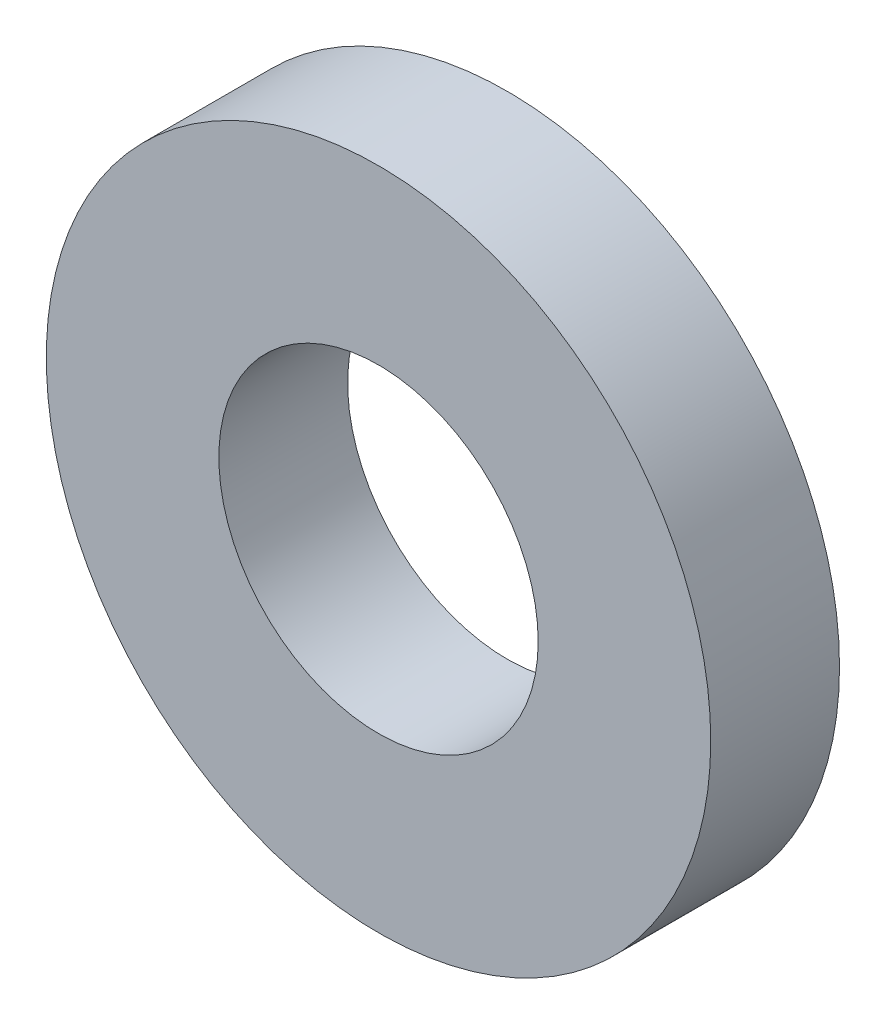
ISO-10303-21;
HEADER;
FILE_DESCRIPTION(('STEP AP214'),'2;1');
FILE_NAME('part.step','',(''),(''),'','','');
FILE_SCHEMA(('AUTOMOTIVE_DESIGN { 1 0 10303 214 1 1 1 1 }'));
ENDSEC;
DATA;
#1=APPLICATION_CONTEXT('core data for automotive mechanical design processes');
#2=APPLICATION_PROTOCOL_DEFINITION('international standard','automotive_design',2000,#1);
#3=PRODUCT_CONTEXT('',#1,'mechanical');
#4=PRODUCT('Part','Part','',(#3));
#5=PRODUCT_RELATED_PRODUCT_CATEGORY('part','',(#4));
#6=PRODUCT_DEFINITION_FORMATION('','',#4);
#7=PRODUCT_DEFINITION_CONTEXT('part definition',#1,'design');
#8=PRODUCT_DEFINITION('design','',#6,#7);
#9=PRODUCT_DEFINITION_SHAPE('','',#8);
#10=(LENGTH_UNIT() NAMED_UNIT(*) SI_UNIT(.MILLI.,.METRE.));
#11=(NAMED_UNIT(*) PLANE_ANGLE_UNIT() SI_UNIT($,.RADIAN.));
#12=(NAMED_UNIT(*) SI_UNIT($,.STERADIAN.) SOLID_ANGLE_UNIT());
#13=UNCERTAINTY_MEASURE_WITH_UNIT(LENGTH_MEASURE(1.E-05),#10,'distance_accuracy_value','');
#14=(GEOMETRIC_REPRESENTATION_CONTEXT(3) GLOBAL_UNCERTAINTY_ASSIGNED_CONTEXT((#13)) GLOBAL_UNIT_ASSIGNED_CONTEXT((#10,
#11,#12)) REPRESENTATION_CONTEXT('',''));
#15=CARTESIAN_POINT('',(0.,0.,0.));
#16=DIRECTION('',(0.,0.,1.));
#17=DIRECTION('',(1.,0.,0.));
#18=AXIS2_PLACEMENT_3D('',#15,#16,#17);
#19=CARTESIAN_POINT('',(0.,0.,5.));
#20=DIRECTION('',(0.,0.,1.));
#21=DIRECTION('',(1.,0.,0.));
#22=AXIS2_PLACEMENT_3D('',#19,#20,#21);
#23=PLANE('',#22);
#24=CARTESIAN_POINT('',(0.,0.,5.));
#25=DIRECTION('',(0.,0.,1.));
#26=DIRECTION('',(1.,0.,0.));
#27=AXIS2_PLACEMENT_3D('',#24,#25,#26);
#28=CIRCLE('',#27,12.9);
#29=CARTESIAN_POINT('',(12.9,0.,5.));
#30=VERTEX_POINT('',#29);
#31=EDGE_CURVE('E10',#30,#30,#28,.T.);
#32=ORIENTED_EDGE('',*,*,#31,.T.);
#33=EDGE_LOOP('',(#32));
#34=FACE_BOUND('',#33,.T.);
#35=CARTESIAN_POINT('',(0.,0.,5.));
#36=DIRECTION('',(0.,0.,1.));
#37=DIRECTION('',(1.,0.,0.));
#38=AXIS2_PLACEMENT_3D('',#35,#36,#37);
#39=CIRCLE('',#38,6.2);
#40=CARTESIAN_POINT('',(6.2,0.,5.));
#41=VERTEX_POINT('',#40);
#42=EDGE_CURVE('E46',#41,#41,#39,.T.);
#43=ORIENTED_EDGE('',*,*,#42,.F.);
#44=EDGE_LOOP('',(#43));
#45=FACE_BOUND('',#44,.T.);
#46=ADVANCED_FACE('F35',(#34,#45),#23,.T.);
#47=CARTESIAN_POINT('',(0.,0.,0.));
#48=DIRECTION('',(0.,0.,1.));
#49=DIRECTION('',(1.,0.,0.));
#50=AXIS2_PLACEMENT_3D('',#47,#48,#49);
#51=PLANE('',#50);
#52=CARTESIAN_POINT('',(0.,0.,0.));
#53=DIRECTION('',(0.,0.,1.));
#54=DIRECTION('',(1.,0.,0.));
#55=AXIS2_PLACEMENT_3D('',#52,#53,#54);
#56=CIRCLE('',#55,12.9);
#57=CARTESIAN_POINT('',(12.9,0.,0.));
#58=VERTEX_POINT('',#57);
#59=EDGE_CURVE('E39',#58,#58,#56,.T.);
#60=ORIENTED_EDGE('',*,*,#59,.F.);
#61=EDGE_LOOP('',(#60));
#62=FACE_BOUND('',#61,.T.);
#63=CARTESIAN_POINT('',(0.,0.,0.));
#64=DIRECTION('',(0.,0.,1.));
#65=DIRECTION('',(1.,0.,0.));
#66=AXIS2_PLACEMENT_3D('',#63,#64,#65);
#67=CIRCLE('',#66,6.2);
#68=CARTESIAN_POINT('',(6.2,0.,0.));
#69=VERTEX_POINT('',#68);
#70=EDGE_CURVE('E48',#69,#69,#67,.T.);
#71=ORIENTED_EDGE('',*,*,#70,.T.);
#72=EDGE_LOOP('',(#71));
#73=FACE_BOUND('',#72,.T.);
#74=ADVANCED_FACE('F58',(#62,#73),#51,.F.);
#75=CARTESIAN_POINT('',(0.,0.,5.));
#76=DIRECTION('',(0.,0.,-1.));
#77=DIRECTION('',(-1.,0.,0.));
#78=AXIS2_PLACEMENT_3D('',#75,#76,#77);
#79=CYLINDRICAL_SURFACE('',#78,12.9);
#80=ORIENTED_EDGE('',*,*,#31,.F.);
#81=EDGE_LOOP('',(#80));
#82=FACE_BOUND('',#81,.T.);
#83=ORIENTED_EDGE('',*,*,#59,.T.);
#84=EDGE_LOOP('',(#83));
#85=FACE_BOUND('',#84,.T.);
#86=ADVANCED_FACE('F37',(#82,#85),#79,.T.);
#87=CARTESIAN_POINT('',(0.,0.,5.));
#88=DIRECTION('',(0.,0.,-1.));
#89=DIRECTION('',(-1.,0.,0.));
#90=AXIS2_PLACEMENT_3D('',#87,#88,#89);
#91=CYLINDRICAL_SURFACE('',#90,6.2);
#92=ORIENTED_EDGE('',*,*,#42,.T.);
#93=EDGE_LOOP('',(#92));
#94=FACE_BOUND('',#93,.T.);
#95=ORIENTED_EDGE('',*,*,#70,.F.);
#96=EDGE_LOOP('',(#95));
#97=FACE_BOUND('',#96,.T.);
#98=ADVANCED_FACE('F54',(#94,#97),#91,.F.);
#99=CLOSED_SHELL('',(#46,#74,#86,#98));
#100=MANIFOLD_SOLID_BREP('B2',#99);
#101=ADVANCED_BREP_SHAPE_REPRESENTATION('',(#18,#100),#14);
#102=SHAPE_DEFINITION_REPRESENTATION(#9,#101);
ENDSEC;
END-ISO-10303-21;
